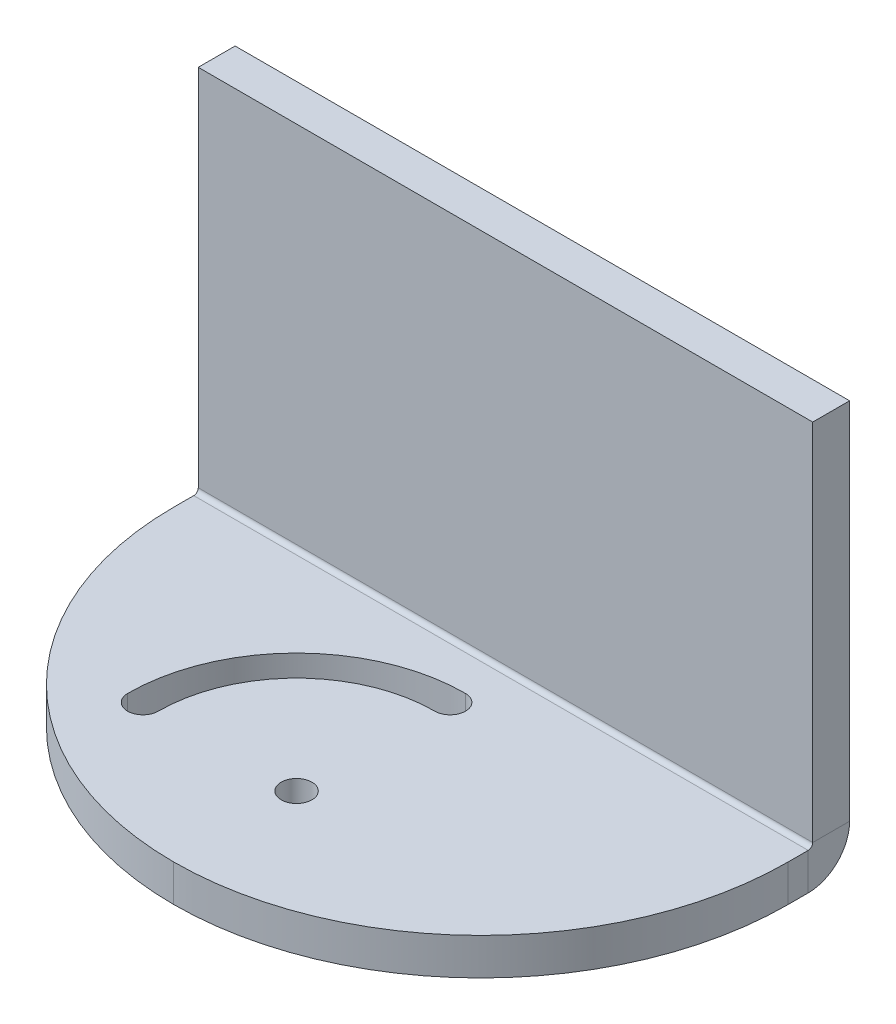
ISO-10303-21;
HEADER;
FILE_DESCRIPTION(('STEP AP214'),'2;1');
FILE_NAME('part.step','',(''),(''),'','','');
FILE_SCHEMA(('AUTOMOTIVE_DESIGN { 1 0 10303 214 1 1 1 1 }'));
ENDSEC;
DATA;
#1=APPLICATION_CONTEXT('core data for automotive mechanical design processes');
#2=APPLICATION_PROTOCOL_DEFINITION('international standard','automotive_design',2000,#1);
#3=PRODUCT_CONTEXT('',#1,'mechanical');
#4=PRODUCT('Part','Part','',(#3));
#5=PRODUCT_RELATED_PRODUCT_CATEGORY('part','',(#4));
#6=PRODUCT_DEFINITION_FORMATION('','',#4);
#7=PRODUCT_DEFINITION_CONTEXT('part definition',#1,'design');
#8=PRODUCT_DEFINITION('design','',#6,#7);
#9=PRODUCT_DEFINITION_SHAPE('','',#8);
#10=(LENGTH_UNIT() NAMED_UNIT(*) SI_UNIT(.MILLI.,.METRE.));
#11=(NAMED_UNIT(*) PLANE_ANGLE_UNIT() SI_UNIT($,.RADIAN.));
#12=(NAMED_UNIT(*) SI_UNIT($,.STERADIAN.) SOLID_ANGLE_UNIT());
#13=UNCERTAINTY_MEASURE_WITH_UNIT(LENGTH_MEASURE(1.E-05),#10,'distance_accuracy_value','');
#14=(GEOMETRIC_REPRESENTATION_CONTEXT(3) GLOBAL_UNCERTAINTY_ASSIGNED_CONTEXT((#13)) GLOBAL_UNIT_ASSIGNED_CONTEXT((#10,
#11,#12)) REPRESENTATION_CONTEXT('',''));
#15=CARTESIAN_POINT('',(0.,0.,0.));
#16=DIRECTION('',(0.,0.,1.));
#17=DIRECTION('',(1.,0.,0.));
#18=AXIS2_PLACEMENT_3D('',#15,#16,#17);
#19=CARTESIAN_POINT('',(50.,30.,-6.));
#20=DIRECTION('',(1.,0.,0.));
#21=DIRECTION('',(0.,0.,-1.));
#22=AXIS2_PLACEMENT_3D('',#19,#20,#21);
#23=PLANE('',#22);
#24=DIRECTION('',(0.,1.,0.));
#25=VECTOR('',#24,1.);
#26=CARTESIAN_POINT('',(50.,30.,0.));
#27=LINE('',#26,#25);
#28=CARTESIAN_POINT('',(50.,-29.2634,0.));
#29=VERTEX_POINT('',#28);
#30=CARTESIAN_POINT('',(50.,30.,0.));
#31=VERTEX_POINT('',#30);
#32=EDGE_CURVE('E227',#29,#31,#27,.T.);
#33=ORIENTED_EDGE('',*,*,#32,.F.);
#34=DIRECTION('',(0.,0.,-1.));
#35=VECTOR('',#34,1.);
#36=CARTESIAN_POINT('',(50.,-29.2634,0.));
#37=LINE('',#36,#35);
#38=CARTESIAN_POINT('',(50.,-29.2634,-5.99999999999999));
#39=VERTEX_POINT('',#38);
#40=EDGE_CURVE('E198',#29,#39,#37,.T.);
#41=ORIENTED_EDGE('',*,*,#40,.T.);
#42=DIRECTION('',(0.,1.,0.));
#43=VECTOR('',#42,1.);
#44=CARTESIAN_POINT('',(50.,30.,-6.));
#45=LINE('',#44,#43);
#46=CARTESIAN_POINT('',(50.,30.,-6.));
#47=VERTEX_POINT('',#46);
#48=EDGE_CURVE('E218',#39,#47,#45,.T.);
#49=ORIENTED_EDGE('',*,*,#48,.T.);
#50=DIRECTION('',(0.,0.,1.));
#51=VECTOR('',#50,1.);
#52=CARTESIAN_POINT('',(50.,30.,-6.));
#53=LINE('',#52,#51);
#54=EDGE_CURVE('E224',#47,#31,#53,.T.);
#55=ORIENTED_EDGE('',*,*,#54,.T.);
#56=EDGE_LOOP('',(#33,#41,#49,#55));
#57=FACE_BOUND('',#56,.T.);
#58=ADVANCED_FACE('F32',(#57),#23,.T.);
#59=CARTESIAN_POINT('',(-50.,-30.,-6.));
#60=DIRECTION('',(0.,0.,1.));
#61=DIRECTION('',(1.,0.,0.));
#62=AXIS2_PLACEMENT_3D('',#59,#60,#61);
#63=PLANE('',#62);
#64=DIRECTION('',(1.,0.,0.));
#65=VECTOR('',#64,1.);
#66=CARTESIAN_POINT('',(50.,-29.2634,-5.99999999999999));
#67=LINE('',#66,#65);
#68=CARTESIAN_POINT('',(-50.,-29.2634,-6.));
#69=VERTEX_POINT('',#68);
#70=EDGE_CURVE('E192',#39,#69,#67,.F.);
#71=ORIENTED_EDGE('',*,*,#70,.T.);
#72=DIRECTION('',(0.,-1.,0.));
#73=VECTOR('',#72,1.);
#74=CARTESIAN_POINT('',(-50.,30.,-6.));
#75=LINE('',#74,#73);
#76=CARTESIAN_POINT('',(-50.,30.,-6.));
#77=VERTEX_POINT('',#76);
#78=EDGE_CURVE('E215',#77,#69,#75,.T.);
#79=ORIENTED_EDGE('',*,*,#78,.F.);
#80=DIRECTION('',(-1.,0.,0.));
#81=VECTOR('',#80,1.);
#82=CARTESIAN_POINT('',(-50.,30.,-6.));
#83=LINE('',#82,#81);
#84=EDGE_CURVE('E221',#47,#77,#83,.T.);
#85=ORIENTED_EDGE('',*,*,#84,.F.);
#86=ORIENTED_EDGE('',*,*,#48,.F.);
#87=EDGE_LOOP('',(#71,#79,#85,#86));
#88=FACE_BOUND('',#87,.T.);
#89=ADVANCED_FACE('F296',(#88),#63,.F.);
#90=CARTESIAN_POINT('',(-50.,-30.,0.));
#91=DIRECTION('',(0.,0.,1.));
#92=DIRECTION('',(1.,0.,0.));
#93=AXIS2_PLACEMENT_3D('',#90,#91,#92);
#94=PLANE('',#93);
#95=DIRECTION('',(0.,-1.,0.));
#96=VECTOR('',#95,1.);
#97=CARTESIAN_POINT('',(-50.,30.,0.));
#98=LINE('',#97,#96);
#99=CARTESIAN_POINT('',(-50.,30.,0.));
#100=VERTEX_POINT('',#99);
#101=CARTESIAN_POINT('',(-50.,-29.2634,0.));
#102=VERTEX_POINT('',#101);
#103=EDGE_CURVE('E212',#100,#102,#98,.T.);
#104=ORIENTED_EDGE('',*,*,#103,.T.);
#105=DIRECTION('',(1.,0.,0.));
#106=VECTOR('',#105,1.);
#107=CARTESIAN_POINT('',(50.,-29.2634,0.));
#108=LINE('',#107,#106);
#109=EDGE_CURVE('E204',#29,#102,#108,.F.);
#110=ORIENTED_EDGE('',*,*,#109,.F.);
#111=ORIENTED_EDGE('',*,*,#32,.T.);
#112=DIRECTION('',(-1.,0.,0.));
#113=VECTOR('',#112,1.);
#114=CARTESIAN_POINT('',(-50.,30.,0.));
#115=LINE('',#114,#113);
#116=EDGE_CURVE('E219',#31,#100,#115,.T.);
#117=ORIENTED_EDGE('',*,*,#116,.T.);
#118=EDGE_LOOP('',(#104,#110,#111,#117));
#119=FACE_BOUND('',#118,.T.);
#120=ADVANCED_FACE('F284',(#119),#94,.T.);
#121=CARTESIAN_POINT('',(-50.,30.,-6.));
#122=DIRECTION('',(-1.,0.,0.));
#123=DIRECTION('',(0.,-1.,0.));
#124=AXIS2_PLACEMENT_3D('',#121,#122,#123);
#125=PLANE('',#124);
#126=DIRECTION('',(0.,0.,-1.));
#127=VECTOR('',#126,1.);
#128=CARTESIAN_POINT('',(-50.,-29.2634,0.));
#129=LINE('',#128,#127);
#130=EDGE_CURVE('E209',#102,#69,#129,.T.);
#131=ORIENTED_EDGE('',*,*,#130,.F.);
#132=ORIENTED_EDGE('',*,*,#103,.F.);
#133=DIRECTION('',(0.,0.,1.));
#134=VECTOR('',#133,1.);
#135=CARTESIAN_POINT('',(-50.,30.,-6.));
#136=LINE('',#135,#134);
#137=EDGE_CURVE('E231',#77,#100,#136,.T.);
#138=ORIENTED_EDGE('',*,*,#137,.F.);
#139=ORIENTED_EDGE('',*,*,#78,.T.);
#140=EDGE_LOOP('',(#131,#132,#138,#139));
#141=FACE_BOUND('',#140,.T.);
#142=ADVANCED_FACE('F294',(#141),#125,.T.);
#143=CARTESIAN_POINT('',(-50.,30.,-6.));
#144=DIRECTION('',(0.,1.,0.));
#145=DIRECTION('',(-1.,0.,0.));
#146=AXIS2_PLACEMENT_3D('',#143,#144,#145);
#147=PLANE('',#146);
#148=ORIENTED_EDGE('',*,*,#116,.F.);
#149=ORIENTED_EDGE('',*,*,#54,.F.);
#150=ORIENTED_EDGE('',*,*,#84,.T.);
#151=ORIENTED_EDGE('',*,*,#137,.T.);
#152=EDGE_LOOP('',(#148,#149,#150,#151));
#153=FACE_BOUND('',#152,.T.);
#154=ADVANCED_FACE('F291',(#153),#147,.T.);
#155=CARTESIAN_POINT('',(-50.,-29.2634,0.736599999999999));
#156=DIRECTION('',(-1.,0.,0.));
#157=DIRECTION('',(0.,0.,1.));
#158=AXIS2_PLACEMENT_3D('',#155,#156,#157);
#159=PLANE('',#158);
#160=DIRECTION('',(0.,-1.,0.));
#161=VECTOR('',#160,1.);
#162=CARTESIAN_POINT('',(-50.,-30.,0.736599999999997));
#163=LINE('',#162,#161);
#164=CARTESIAN_POINT('',(-50.,-30.,0.736599999999997));
#165=VERTEX_POINT('',#164);
#166=CARTESIAN_POINT('',(-50.,-36.,0.736599999999975));
#167=VERTEX_POINT('',#166);
#168=EDGE_CURVE('E173',#165,#167,#163,.T.);
#169=ORIENTED_EDGE('',*,*,#168,.F.);
#170=CARTESIAN_POINT('',(-50.,-29.2634,0.736599999999999));
#171=DIRECTION('',(1.,0.,0.));
#172=DIRECTION('',(0.,0.,-1.));
#173=AXIS2_PLACEMENT_3D('',#170,#171,#172);
#174=CIRCLE('',#173,0.7366);
#175=EDGE_CURVE('E201',#102,#165,#174,.F.);
#176=ORIENTED_EDGE('',*,*,#175,.F.);
#177=ORIENTED_EDGE('',*,*,#130,.T.);
#178=CARTESIAN_POINT('',(-50.,-29.2634,0.736599999999999));
#179=DIRECTION('',(1.,0.,0.));
#180=DIRECTION('',(0.,0.,-1.));
#181=AXIS2_PLACEMENT_3D('',#178,#179,#180);
#182=CIRCLE('',#181,6.7366);
#183=EDGE_CURVE('E194',#69,#167,#182,.F.);
#184=ORIENTED_EDGE('',*,*,#183,.T.);
#185=EDGE_LOOP('',(#169,#176,#177,#184));
#186=FACE_BOUND('',#185,.T.);
#187=ADVANCED_FACE('F276',(#186),#159,.T.);
#188=CARTESIAN_POINT('',(50.,-29.2634,0.736600000000007));
#189=DIRECTION('',(-1.,0.,0.));
#190=DIRECTION('',(0.,0.,1.));
#191=AXIS2_PLACEMENT_3D('',#188,#189,#190);
#192=PLANE('',#191);
#193=CARTESIAN_POINT('',(50.,-29.2634,0.736600000000007));
#194=DIRECTION('',(1.,0.,0.));
#195=DIRECTION('',(0.,0.,-1.));
#196=AXIS2_PLACEMENT_3D('',#193,#194,#195);
#197=CIRCLE('',#196,0.7366);
#198=CARTESIAN_POINT('',(50.,-30.,0.736600000000004));
#199=VERTEX_POINT('',#198);
#200=EDGE_CURVE('E188',#199,#29,#197,.T.);
#201=ORIENTED_EDGE('',*,*,#200,.F.);
#202=DIRECTION('',(0.,-1.,0.));
#203=VECTOR('',#202,1.);
#204=CARTESIAN_POINT('',(50.,-30.,0.736600000000004));
#205=LINE('',#204,#203);
#206=CARTESIAN_POINT('',(50.,-36.,0.736599999999983));
#207=VERTEX_POINT('',#206);
#208=EDGE_CURVE('E172',#199,#207,#205,.T.);
#209=ORIENTED_EDGE('',*,*,#208,.T.);
#210=CARTESIAN_POINT('',(50.,-29.2634,0.736600000000007));
#211=DIRECTION('',(1.,0.,0.));
#212=DIRECTION('',(0.,0.,-1.));
#213=AXIS2_PLACEMENT_3D('',#210,#211,#212);
#214=CIRCLE('',#213,6.7366);
#215=EDGE_CURVE('E195',#207,#39,#214,.T.);
#216=ORIENTED_EDGE('',*,*,#215,.T.);
#217=ORIENTED_EDGE('',*,*,#40,.F.);
#218=EDGE_LOOP('',(#201,#209,#216,#217));
#219=FACE_BOUND('',#218,.T.);
#220=ADVANCED_FACE('F268',(#219),#192,.F.);
#221=CARTESIAN_POINT('',(50.,-29.2634,0.736600000000007));
#222=DIRECTION('',(1.,0.,0.));
#223=DIRECTION('',(0.,-1.,0.));
#224=AXIS2_PLACEMENT_3D('',#221,#222,#223);
#225=CYLINDRICAL_SURFACE('',#224,6.7366);
#226=ORIENTED_EDGE('',*,*,#70,.F.);
#227=ORIENTED_EDGE('',*,*,#215,.F.);
#228=DIRECTION('',(-1.,0.,0.));
#229=VECTOR('',#228,1.);
#230=CARTESIAN_POINT('',(-50.,-36.,0.736599999999976));
#231=LINE('',#230,#229);
#232=EDGE_CURVE('E176',#207,#167,#231,.T.);
#233=ORIENTED_EDGE('',*,*,#232,.T.);
#234=ORIENTED_EDGE('',*,*,#183,.F.);
#235=EDGE_LOOP('',(#226,#227,#233,#234));
#236=FACE_BOUND('',#235,.T.);
#237=ADVANCED_FACE('F273',(#236),#225,.T.);
#238=CARTESIAN_POINT('',(50.,-29.2634,0.736600000000007));
#239=DIRECTION('',(1.,0.,0.));
#240=DIRECTION('',(0.,-1.,0.));
#241=AXIS2_PLACEMENT_3D('',#238,#239,#240);
#242=CYLINDRICAL_SURFACE('',#241,0.7366);
#243=ORIENTED_EDGE('',*,*,#109,.T.);
#244=ORIENTED_EDGE('',*,*,#175,.T.);
#245=DIRECTION('',(1.,0.,0.));
#246=VECTOR('',#245,1.);
#247=CARTESIAN_POINT('',(-50.,-30.,0.736599999999997));
#248=LINE('',#247,#246);
#249=EDGE_CURVE('E170',#165,#199,#248,.T.);
#250=ORIENTED_EDGE('',*,*,#249,.T.);
#251=ORIENTED_EDGE('',*,*,#200,.T.);
#252=EDGE_LOOP('',(#243,#244,#250,#251));
#253=FACE_BOUND('',#252,.T.);
#254=ADVANCED_FACE('F281',(#253),#242,.F.);
#255=CARTESIAN_POINT('',(-50.,-36.,0.));
#256=DIRECTION('',(1.,0.,0.));
#257=DIRECTION('',(0.,0.,-1.));
#258=AXIS2_PLACEMENT_3D('',#255,#256,#257);
#259=PLANE('',#258);
#260=DIRECTION('',(0.,0.,-1.));
#261=VECTOR('',#260,1.);
#262=CARTESIAN_POINT('',(-50.,-36.,0.));
#263=LINE('',#262,#261);
#264=CARTESIAN_POINT('',(-50.,-36.,4.));
#265=VERTEX_POINT('',#264);
#266=EDGE_CURVE('E182',#265,#167,#263,.T.);
#267=ORIENTED_EDGE('',*,*,#266,.F.);
#268=DIRECTION('',(0.,1.,0.));
#269=VECTOR('',#268,1.);
#270=CARTESIAN_POINT('',(-50.,-36.,4.));
#271=LINE('',#270,#269);
#272=CARTESIAN_POINT('',(-50.,-30.,4.00000000000002));
#273=VERTEX_POINT('',#272);
#274=EDGE_CURVE('E11',#265,#273,#271,.T.);
#275=ORIENTED_EDGE('',*,*,#274,.T.);
#276=DIRECTION('',(0.,0.,-1.));
#277=VECTOR('',#276,1.);
#278=CARTESIAN_POINT('',(-50.,-30.,0.));
#279=LINE('',#278,#277);
#280=EDGE_CURVE('E181',#273,#165,#279,.T.);
#281=ORIENTED_EDGE('',*,*,#280,.T.);
#282=ORIENTED_EDGE('',*,*,#168,.T.);
#283=EDGE_LOOP('',(#267,#275,#281,#282));
#284=FACE_BOUND('',#283,.T.);
#285=ADVANCED_FACE('F279',(#284),#259,.F.);
#286=CARTESIAN_POINT('',(50.,-36.0000000000002,54.));
#287=DIRECTION('',(-1.,0.,0.));
#288=DIRECTION('',(0.,0.,1.));
#289=AXIS2_PLACEMENT_3D('',#286,#287,#288);
#290=PLANE('',#289);
#291=DIRECTION('',(0.,0.,1.));
#292=VECTOR('',#291,1.);
#293=CARTESIAN_POINT('',(50.,-30.0000000000002,54.));
#294=LINE('',#293,#292);
#295=CARTESIAN_POINT('',(50.,-30.,4.00000000000002));
#296=VERTEX_POINT('',#295);
#297=EDGE_CURVE('E185',#199,#296,#294,.T.);
#298=ORIENTED_EDGE('',*,*,#297,.T.);
#299=DIRECTION('',(0.,1.,0.));
#300=VECTOR('',#299,1.);
#301=CARTESIAN_POINT('',(50.,-36.,4.));
#302=LINE('',#301,#300);
#303=CARTESIAN_POINT('',(50.,-36.,4.));
#304=VERTEX_POINT('',#303);
#305=EDGE_CURVE('E239',#296,#304,#302,.F.);
#306=ORIENTED_EDGE('',*,*,#305,.T.);
#307=DIRECTION('',(0.,0.,1.));
#308=VECTOR('',#307,1.);
#309=CARTESIAN_POINT('',(50.,-36.0000000000002,54.));
#310=LINE('',#309,#308);
#311=EDGE_CURVE('E184',#207,#304,#310,.T.);
#312=ORIENTED_EDGE('',*,*,#311,.F.);
#313=ORIENTED_EDGE('',*,*,#208,.F.);
#314=EDGE_LOOP('',(#298,#306,#312,#313));
#315=FACE_BOUND('',#314,.T.);
#316=ADVANCED_FACE('F265',(#315),#290,.F.);
#317=CARTESIAN_POINT('',(-50.,-36.0000000000002,54.));
#318=DIRECTION('',(0.,1.,0.));
#319=DIRECTION('',(0.,0.,1.));
#320=AXIS2_PLACEMENT_3D('',#317,#318,#319);
#321=PLANE('',#320);
#322=CARTESIAN_POINT('',(0.,-36.0000000000001,34.));
#323=DIRECTION('',(0.,1.,0.));
#324=DIRECTION('',(0.,0.,1.));
#325=AXIS2_PLACEMENT_3D('',#322,#323,#324);
#326=CIRCLE('',#325,27.5);
#327=CARTESIAN_POINT('',(0.,-36.,6.50000000000002));
#328=VERTEX_POINT('',#327);
#329=CARTESIAN_POINT('',(-27.5,-36.0000000000002,34.));
#330=VERTEX_POINT('',#329);
#331=EDGE_CURVE('E158',#328,#330,#326,.T.);
#332=ORIENTED_EDGE('',*,*,#331,.T.);
#333=CARTESIAN_POINT('',(-25.,-36.0000000000001,34.));
#334=DIRECTION('',(0.,1.,0.));
#335=DIRECTION('',(0.,0.,1.));
#336=AXIS2_PLACEMENT_3D('',#333,#334,#335);
#337=CIRCLE('',#336,2.49999999999999);
#338=CARTESIAN_POINT('',(-22.5,-36.0000000000002,34.));
#339=VERTEX_POINT('',#338);
#340=EDGE_CURVE('E161',#330,#339,#337,.T.);
#341=ORIENTED_EDGE('',*,*,#340,.T.);
#342=CARTESIAN_POINT('',(0.,-36.0000000000001,34.));
#343=DIRECTION('',(0.,1.,0.));
#344=DIRECTION('',(0.,0.,1.));
#345=AXIS2_PLACEMENT_3D('',#342,#343,#344);
#346=CIRCLE('',#345,22.5);
#347=CARTESIAN_POINT('',(0.,-36.,11.5));
#348=VERTEX_POINT('',#347);
#349=EDGE_CURVE('E153',#339,#348,#346,.F.);
#350=ORIENTED_EDGE('',*,*,#349,.T.);
#351=CARTESIAN_POINT('',(0.,-36.,9.00000000000001));
#352=DIRECTION('',(0.,1.,0.));
#353=DIRECTION('',(0.,0.,1.));
#354=AXIS2_PLACEMENT_3D('',#351,#352,#353);
#355=CIRCLE('',#354,2.49999999999999);
#356=EDGE_CURVE('E133',#348,#328,#355,.T.);
#357=ORIENTED_EDGE('',*,*,#356,.T.);
#358=EDGE_LOOP('',(#332,#341,#350,#357));
#359=FACE_BOUND('',#358,.T.);
#360=CARTESIAN_POINT('',(0.,-36.0000000000001,34.));
#361=DIRECTION('',(0.,1.,0.));
#362=DIRECTION('',(0.,0.,1.));
#363=AXIS2_PLACEMENT_3D('',#360,#361,#362);
#364=CIRCLE('',#363,2.5);
#365=CARTESIAN_POINT('',(0.,-36.0000000000001,36.5));
#366=VERTEX_POINT('',#365);
#367=EDGE_CURVE('E167',#366,#366,#364,.T.);
#368=ORIENTED_EDGE('',*,*,#367,.T.);
#369=EDGE_LOOP('',(#368));
#370=FACE_BOUND('',#369,.T.);
#371=ORIENTED_EDGE('',*,*,#311,.T.);
#372=CARTESIAN_POINT('',(0.,-36.,4.));
#373=DIRECTION('',(0.,1.,0.));
#374=DIRECTION('',(0.,0.,1.));
#375=AXIS2_PLACEMENT_3D('',#372,#373,#374);
#376=CIRCLE('',#375,50.);
#377=CARTESIAN_POINT('',(0.,-36.0000000000002,54.));
#378=VERTEX_POINT('',#377);
#379=EDGE_CURVE('E41',#304,#378,#376,.F.);
#380=ORIENTED_EDGE('',*,*,#379,.T.);
#381=CARTESIAN_POINT('',(0.,-36.,4.));
#382=DIRECTION('',(0.,1.,0.));
#383=DIRECTION('',(0.,0.,1.));
#384=AXIS2_PLACEMENT_3D('',#381,#382,#383);
#385=CIRCLE('',#384,50.);
#386=EDGE_CURVE('E242',#378,#265,#385,.F.);
#387=ORIENTED_EDGE('',*,*,#386,.T.);
#388=ORIENTED_EDGE('',*,*,#266,.T.);
#389=ORIENTED_EDGE('',*,*,#232,.F.);
#390=EDGE_LOOP('',(#371,#380,#387,#388,#389));
#391=FACE_BOUND('',#390,.T.);
#392=ADVANCED_FACE('F246',(#359,#370,#391),#321,.F.);
#393=CARTESIAN_POINT('',(-50.,-30.0000000000002,54.));
#394=DIRECTION('',(0.,1.,0.));
#395=DIRECTION('',(0.,0.,1.));
#396=AXIS2_PLACEMENT_3D('',#393,#394,#395);
#397=PLANE('',#396);
#398=CARTESIAN_POINT('',(-25.,-30.0000000000001,34.));
#399=DIRECTION('',(0.,1.,0.));
#400=DIRECTION('',(0.,0.,1.));
#401=AXIS2_PLACEMENT_3D('',#398,#399,#400);
#402=CIRCLE('',#401,2.49999999999999);
#403=CARTESIAN_POINT('',(-27.5,-30.0000000000001,34.));
#404=VERTEX_POINT('',#403);
#405=CARTESIAN_POINT('',(-22.5,-30.0000000000001,34.));
#406=VERTEX_POINT('',#405);
#407=EDGE_CURVE('E56',#404,#406,#402,.T.);
#408=ORIENTED_EDGE('',*,*,#407,.F.);
#409=CARTESIAN_POINT('',(0.,-30.0000000000001,34.));
#410=DIRECTION('',(0.,1.,0.));
#411=DIRECTION('',(0.,0.,-1.));
#412=AXIS2_PLACEMENT_3D('',#409,#410,#411);
#413=CIRCLE('',#412,27.5);
#414=CARTESIAN_POINT('',(0.,-30.,6.50000000000004));
#415=VERTEX_POINT('',#414);
#416=EDGE_CURVE('E146',#415,#404,#413,.T.);
#417=ORIENTED_EDGE('',*,*,#416,.F.);
#418=CARTESIAN_POINT('',(0.,-30.,9.00000000000003));
#419=DIRECTION('',(0.,1.,0.));
#420=DIRECTION('',(0.,0.,-1.));
#421=AXIS2_PLACEMENT_3D('',#418,#419,#420);
#422=CIRCLE('',#421,2.49999999999999);
#423=CARTESIAN_POINT('',(0.,-30.,11.5));
#424=VERTEX_POINT('',#423);
#425=EDGE_CURVE('E130',#424,#415,#422,.T.);
#426=ORIENTED_EDGE('',*,*,#425,.F.);
#427=CARTESIAN_POINT('',(0.,-30.0000000000001,34.));
#428=DIRECTION('',(0.,-1.,0.));
#429=DIRECTION('',(0.,0.,-1.));
#430=AXIS2_PLACEMENT_3D('',#427,#428,#429);
#431=CIRCLE('',#430,22.5);
#432=EDGE_CURVE('E139',#406,#424,#431,.T.);
#433=ORIENTED_EDGE('',*,*,#432,.F.);
#434=EDGE_LOOP('',(#408,#417,#426,#433));
#435=FACE_BOUND('',#434,.T.);
#436=CARTESIAN_POINT('',(0.,-30.0000000000001,34.));
#437=DIRECTION('',(0.,1.,0.));
#438=DIRECTION('',(0.,0.,1.));
#439=AXIS2_PLACEMENT_3D('',#436,#437,#438);
#440=CIRCLE('',#439,2.5);
#441=CARTESIAN_POINT('',(0.,-30.0000000000001,36.5));
#442=VERTEX_POINT('',#441);
#443=EDGE_CURVE('E164',#442,#442,#440,.T.);
#444=ORIENTED_EDGE('',*,*,#443,.F.);
#445=EDGE_LOOP('',(#444));
#446=FACE_BOUND('',#445,.T.);
#447=CARTESIAN_POINT('',(0.,-30.,4.00000000000002));
#448=DIRECTION('',(0.,1.,0.));
#449=DIRECTION('',(0.,0.,1.));
#450=AXIS2_PLACEMENT_3D('',#447,#448,#449);
#451=CIRCLE('',#450,50.);
#452=CARTESIAN_POINT('',(0.,-30.0000000000002,54.));
#453=VERTEX_POINT('',#452);
#454=EDGE_CURVE('E233',#273,#453,#451,.T.);
#455=ORIENTED_EDGE('',*,*,#454,.T.);
#456=CARTESIAN_POINT('',(0.,-30.,4.00000000000002));
#457=DIRECTION('',(0.,1.,0.));
#458=DIRECTION('',(0.,0.,1.));
#459=AXIS2_PLACEMENT_3D('',#456,#457,#458);
#460=CIRCLE('',#459,50.);
#461=EDGE_CURVE('E237',#453,#296,#460,.T.);
#462=ORIENTED_EDGE('',*,*,#461,.T.);
#463=ORIENTED_EDGE('',*,*,#297,.F.);
#464=ORIENTED_EDGE('',*,*,#249,.F.);
#465=ORIENTED_EDGE('',*,*,#280,.F.);
#466=EDGE_LOOP('',(#455,#462,#463,#464,#465));
#467=FACE_BOUND('',#466,.T.);
#468=ADVANCED_FACE('F143',(#435,#446,#467),#397,.T.);
#469=CARTESIAN_POINT('',(0.,-36.,4.));
#470=DIRECTION('',(0.,1.,0.));
#471=DIRECTION('',(0.,0.,1.));
#472=AXIS2_PLACEMENT_3D('',#469,#470,#471);
#473=CYLINDRICAL_SURFACE('',#472,50.);
#474=ORIENTED_EDGE('',*,*,#274,.F.);
#475=ORIENTED_EDGE('',*,*,#386,.F.);
#476=DIRECTION('',(0.,1.,0.));
#477=VECTOR('',#476,1.);
#478=CARTESIAN_POINT('',(0.,-36.0000000000002,54.));
#479=LINE('',#478,#477);
#480=EDGE_CURVE('E36',#453,#378,#479,.F.);
#481=ORIENTED_EDGE('',*,*,#480,.F.);
#482=ORIENTED_EDGE('',*,*,#454,.F.);
#483=EDGE_LOOP('',(#474,#475,#481,#482));
#484=FACE_BOUND('',#483,.T.);
#485=ADVANCED_FACE('F34',(#484),#473,.T.);
#486=CARTESIAN_POINT('',(0.,-36.,4.));
#487=DIRECTION('',(0.,1.,0.));
#488=DIRECTION('',(0.,0.,1.));
#489=AXIS2_PLACEMENT_3D('',#486,#487,#488);
#490=CYLINDRICAL_SURFACE('',#489,50.);
#491=ORIENTED_EDGE('',*,*,#379,.F.);
#492=ORIENTED_EDGE('',*,*,#305,.F.);
#493=ORIENTED_EDGE('',*,*,#461,.F.);
#494=ORIENTED_EDGE('',*,*,#480,.T.);
#495=EDGE_LOOP('',(#491,#492,#493,#494));
#496=FACE_BOUND('',#495,.T.);
#497=ADVANCED_FACE('F258',(#496),#490,.T.);
#498=CARTESIAN_POINT('',(0.,-40.0000000000001,34.));
#499=DIRECTION('',(0.,1.,0.));
#500=DIRECTION('',(0.,0.,1.));
#501=AXIS2_PLACEMENT_3D('',#498,#499,#500);
#502=CYLINDRICAL_SURFACE('',#501,2.5);
#503=ORIENTED_EDGE('',*,*,#443,.T.);
#504=EDGE_LOOP('',(#503));
#505=FACE_BOUND('',#504,.T.);
#506=ORIENTED_EDGE('',*,*,#367,.F.);
#507=EDGE_LOOP('',(#506));
#508=FACE_BOUND('',#507,.T.);
#509=ADVANCED_FACE('F312',(#505,#508),#502,.F.);
#510=CARTESIAN_POINT('',(-25.,-40.0000000000001,34.));
#511=DIRECTION('',(0.,1.,0.));
#512=DIRECTION('',(0.,0.,1.));
#513=AXIS2_PLACEMENT_3D('',#510,#511,#512);
#514=CYLINDRICAL_SURFACE('',#513,2.49999999999999);
#515=DIRECTION('',(0.,1.,0.));
#516=VECTOR('',#515,1.);
#517=CARTESIAN_POINT('',(-27.5,-40.0000000000001,34.));
#518=LINE('',#517,#516);
#519=EDGE_CURVE('E151',#330,#404,#518,.T.);
#520=ORIENTED_EDGE('',*,*,#519,.T.);
#521=ORIENTED_EDGE('',*,*,#407,.T.);
#522=DIRECTION('',(0.,1.,0.));
#523=VECTOR('',#522,1.);
#524=CARTESIAN_POINT('',(-22.5,-40.0000000000001,34.));
#525=LINE('',#524,#523);
#526=EDGE_CURVE('E136',#339,#406,#525,.T.);
#527=ORIENTED_EDGE('',*,*,#526,.F.);
#528=ORIENTED_EDGE('',*,*,#340,.F.);
#529=EDGE_LOOP('',(#520,#521,#527,#528));
#530=FACE_BOUND('',#529,.T.);
#531=ADVANCED_FACE('F317',(#530),#514,.F.);
#532=CARTESIAN_POINT('',(0.,-40.0000000000001,34.));
#533=DIRECTION('',(0.,1.,0.));
#534=DIRECTION('',(0.,0.,1.));
#535=AXIS2_PLACEMENT_3D('',#532,#533,#534);
#536=CYLINDRICAL_SURFACE('',#535,27.5);
#537=DIRECTION('',(0.,1.,0.));
#538=VECTOR('',#537,1.);
#539=CARTESIAN_POINT('',(0.,-40.,6.50000000000001));
#540=LINE('',#539,#538);
#541=EDGE_CURVE('E135',#328,#415,#540,.T.);
#542=ORIENTED_EDGE('',*,*,#541,.T.);
#543=ORIENTED_EDGE('',*,*,#416,.T.);
#544=ORIENTED_EDGE('',*,*,#519,.F.);
#545=ORIENTED_EDGE('',*,*,#331,.F.);
#546=EDGE_LOOP('',(#542,#543,#544,#545));
#547=FACE_BOUND('',#546,.T.);
#548=ADVANCED_FACE('F382',(#547),#536,.F.);
#549=CARTESIAN_POINT('',(0.,-40.,9.));
#550=DIRECTION('',(0.,1.,0.));
#551=DIRECTION('',(0.,0.,1.));
#552=AXIS2_PLACEMENT_3D('',#549,#550,#551);
#553=CYLINDRICAL_SURFACE('',#552,2.49999999999999);
#554=DIRECTION('',(0.,1.,0.));
#555=VECTOR('',#554,1.);
#556=CARTESIAN_POINT('',(0.,-40.,11.5));
#557=LINE('',#556,#555);
#558=EDGE_CURVE('E48',#348,#424,#557,.T.);
#559=ORIENTED_EDGE('',*,*,#558,.T.);
#560=ORIENTED_EDGE('',*,*,#425,.T.);
#561=ORIENTED_EDGE('',*,*,#541,.F.);
#562=ORIENTED_EDGE('',*,*,#356,.F.);
#563=EDGE_LOOP('',(#559,#560,#561,#562));
#564=FACE_BOUND('',#563,.T.);
#565=ADVANCED_FACE('F127',(#564),#553,.F.);
#566=CARTESIAN_POINT('',(0.,-40.0000000000001,34.));
#567=DIRECTION('',(0.,1.,0.));
#568=DIRECTION('',(0.,0.,1.));
#569=AXIS2_PLACEMENT_3D('',#566,#567,#568);
#570=CYLINDRICAL_SURFACE('',#569,22.5);
#571=ORIENTED_EDGE('',*,*,#526,.T.);
#572=ORIENTED_EDGE('',*,*,#432,.T.);
#573=ORIENTED_EDGE('',*,*,#558,.F.);
#574=ORIENTED_EDGE('',*,*,#349,.F.);
#575=EDGE_LOOP('',(#571,#572,#573,#574));
#576=FACE_BOUND('',#575,.T.);
#577=ADVANCED_FACE('F140',(#576),#570,.T.);
#578=CLOSED_SHELL('',(#58,#89,#120,#142,#154,#187,#220,#237,#254,#285,#316,#392,#468,#485,#497,
#509,#531,#548,#565,#577));
#579=MANIFOLD_SOLID_BREP('B2',#578);
#580=ADVANCED_BREP_SHAPE_REPRESENTATION('',(#18,#579),#14);
#581=SHAPE_DEFINITION_REPRESENTATION(#9,#580);
ENDSEC;
END-ISO-10303-21;
